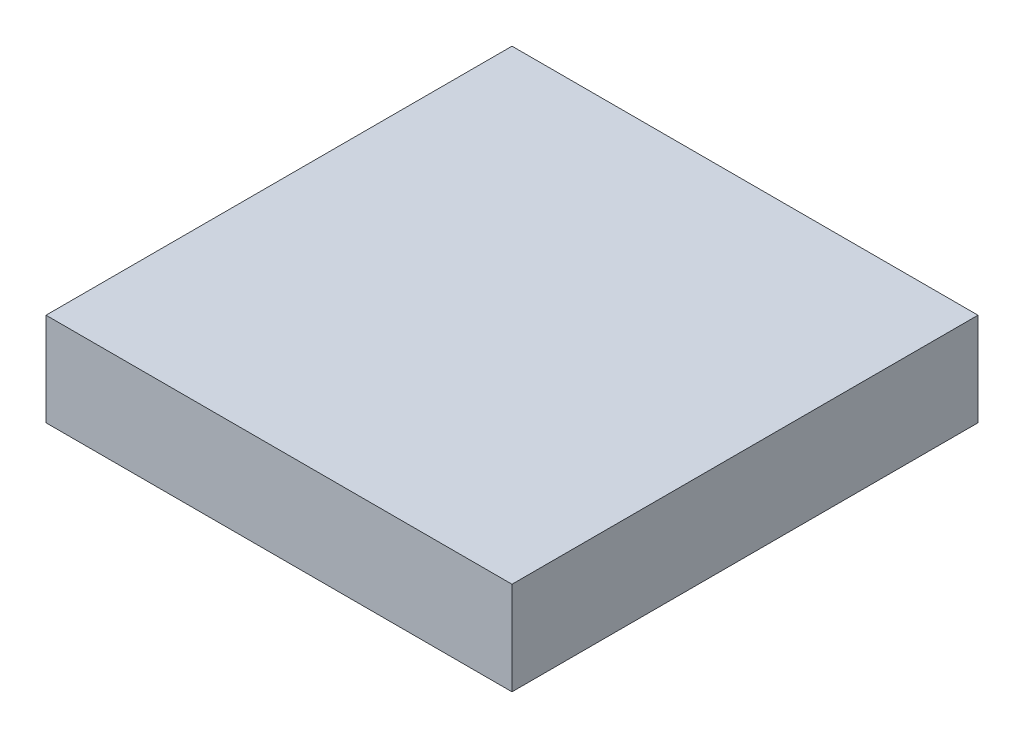
ISO-10303-21;
HEADER;
FILE_DESCRIPTION(('STEP AP214'),'2;1');
FILE_NAME('part.step','',(''),(''),'','','');
FILE_SCHEMA(('AUTOMOTIVE_DESIGN { 1 0 10303 214 1 1 1 1 }'));
ENDSEC;
DATA;
#1=APPLICATION_CONTEXT('core data for automotive mechanical design processes');
#2=APPLICATION_PROTOCOL_DEFINITION('international standard','automotive_design',2000,#1);
#3=PRODUCT_CONTEXT('',#1,'mechanical');
#4=PRODUCT('Part','Part','',(#3));
#5=PRODUCT_RELATED_PRODUCT_CATEGORY('part','',(#4));
#6=PRODUCT_DEFINITION_FORMATION('','',#4);
#7=PRODUCT_DEFINITION_CONTEXT('part definition',#1,'design');
#8=PRODUCT_DEFINITION('design','',#6,#7);
#9=PRODUCT_DEFINITION_SHAPE('','',#8);
#10=(LENGTH_UNIT() NAMED_UNIT(*) SI_UNIT(.MILLI.,.METRE.));
#11=(NAMED_UNIT(*) PLANE_ANGLE_UNIT() SI_UNIT($,.RADIAN.));
#12=(NAMED_UNIT(*) SI_UNIT($,.STERADIAN.) SOLID_ANGLE_UNIT());
#13=UNCERTAINTY_MEASURE_WITH_UNIT(LENGTH_MEASURE(1.E-05),#10,'distance_accuracy_value','');
#14=(GEOMETRIC_REPRESENTATION_CONTEXT(3) GLOBAL_UNCERTAINTY_ASSIGNED_CONTEXT((#13)) GLOBAL_UNIT_ASSIGNED_CONTEXT((#10,
#11,#12)) REPRESENTATION_CONTEXT('',''));
#15=CARTESIAN_POINT('',(0.,0.,0.));
#16=DIRECTION('',(0.,0.,1.));
#17=DIRECTION('',(1.,0.,0.));
#18=AXIS2_PLACEMENT_3D('',#15,#16,#17);
#19=CARTESIAN_POINT('',(0.2499995,-0.0499999,0.));
#20=DIRECTION('',(0.,-1.,0.));
#21=DIRECTION('',(0.,0.,-1.));
#22=AXIS2_PLACEMENT_3D('',#19,#20,#21);
#23=PLANE('',#22);
#24=DIRECTION('',(0.,0.,1.));
#25=VECTOR('',#24,1.);
#26=CARTESIAN_POINT('',(-0.2499995,-0.0499999,0.));
#27=LINE('',#26,#25);
#28=CARTESIAN_POINT('',(-0.2499995,-0.0499999,0.));
#29=VERTEX_POINT('',#28);
#30=CARTESIAN_POINT('',(-0.2499995,-0.0499999,0.499999));
#31=VERTEX_POINT('',#30);
#32=EDGE_CURVE('E20',#29,#31,#27,.T.);
#33=ORIENTED_EDGE('',*,*,#32,.F.);
#34=DIRECTION('',(1.,0.,0.));
#35=VECTOR('',#34,1.);
#36=CARTESIAN_POINT('',(-0.2499995,-0.0499999,0.));
#37=LINE('',#36,#35);
#38=CARTESIAN_POINT('',(0.2499995,-0.0499999,0.));
#39=VERTEX_POINT('',#38);
#40=EDGE_CURVE('E79',#29,#39,#37,.T.);
#41=ORIENTED_EDGE('',*,*,#40,.T.);
#42=DIRECTION('',(0.,0.,-1.));
#43=VECTOR('',#42,1.);
#44=CARTESIAN_POINT('',(0.2499995,-0.0499999,0.));
#45=LINE('',#44,#43);
#46=CARTESIAN_POINT('',(0.2499995,-0.0499999,0.499999));
#47=VERTEX_POINT('',#46);
#48=EDGE_CURVE('E61',#47,#39,#45,.T.);
#49=ORIENTED_EDGE('',*,*,#48,.F.);
#50=DIRECTION('',(1.,0.,0.));
#51=VECTOR('',#50,1.);
#52=CARTESIAN_POINT('',(-0.2499995,-0.0499999,0.499999));
#53=LINE('',#52,#51);
#54=EDGE_CURVE('E56',#31,#47,#53,.T.);
#55=ORIENTED_EDGE('',*,*,#54,.F.);
#56=EDGE_LOOP('',(#33,#41,#49,#55));
#57=FACE_BOUND('',#56,.T.);
#58=ADVANCED_FACE('F17',(#57),#23,.T.);
#59=CARTESIAN_POINT('',(-0.2499995,-0.0499999,0.));
#60=DIRECTION('',(-1.,0.,0.));
#61=DIRECTION('',(0.,0.,1.));
#62=AXIS2_PLACEMENT_3D('',#59,#60,#61);
#63=PLANE('',#62);
#64=DIRECTION('',(0.,0.,1.));
#65=VECTOR('',#64,1.);
#66=CARTESIAN_POINT('',(-0.2499995,0.05000244,0.));
#67=LINE('',#66,#65);
#68=CARTESIAN_POINT('',(-0.2499995,0.05000244,0.));
#69=VERTEX_POINT('',#68);
#70=CARTESIAN_POINT('',(-0.2499995,0.05000244,0.499999));
#71=VERTEX_POINT('',#70);
#72=EDGE_CURVE('E83',#69,#71,#67,.T.);
#73=ORIENTED_EDGE('',*,*,#72,.F.);
#74=DIRECTION('',(0.,1.,0.));
#75=VECTOR('',#74,1.);
#76=CARTESIAN_POINT('',(-0.2499995,-0.0499999,0.));
#77=LINE('',#76,#75);
#78=EDGE_CURVE('E68',#69,#29,#77,.F.);
#79=ORIENTED_EDGE('',*,*,#78,.T.);
#80=ORIENTED_EDGE('',*,*,#32,.T.);
#81=DIRECTION('',(0.,1.,0.));
#82=VECTOR('',#81,1.);
#83=CARTESIAN_POINT('',(-0.2499995,-0.0499999,0.499999));
#84=LINE('',#83,#82);
#85=EDGE_CURVE('E63',#71,#31,#84,.F.);
#86=ORIENTED_EDGE('',*,*,#85,.F.);
#87=EDGE_LOOP('',(#73,#79,#80,#86));
#88=FACE_BOUND('',#87,.T.);
#89=ADVANCED_FACE('F65',(#88),#63,.T.);
#90=CARTESIAN_POINT('',(-0.2499995,-0.0499999,0.499999));
#91=DIRECTION('',(0.,0.,1.));
#92=DIRECTION('',(1.,0.,0.));
#93=AXIS2_PLACEMENT_3D('',#90,#91,#92);
#94=PLANE('',#93);
#95=DIRECTION('',(1.,0.,0.));
#96=VECTOR('',#95,1.);
#97=CARTESIAN_POINT('',(-0.2499995,0.05000244,0.499999));
#98=LINE('',#97,#96);
#99=CARTESIAN_POINT('',(0.2499995,0.05000244,0.499999));
#100=VERTEX_POINT('',#99);
#101=EDGE_CURVE('E72',#71,#100,#98,.T.);
#102=ORIENTED_EDGE('',*,*,#101,.F.);
#103=ORIENTED_EDGE('',*,*,#85,.T.);
#104=ORIENTED_EDGE('',*,*,#54,.T.);
#105=DIRECTION('',(0.,1.,0.));
#106=VECTOR('',#105,1.);
#107=CARTESIAN_POINT('',(0.2499995,0.05000244,0.499999));
#108=LINE('',#107,#106);
#109=EDGE_CURVE('E74',#100,#47,#108,.F.);
#110=ORIENTED_EDGE('',*,*,#109,.F.);
#111=EDGE_LOOP('',(#102,#103,#104,#110));
#112=FACE_BOUND('',#111,.T.);
#113=ADVANCED_FACE('F70',(#112),#94,.T.);
#114=CARTESIAN_POINT('',(0.2499995,0.05000244,0.));
#115=DIRECTION('',(1.,0.,0.));
#116=DIRECTION('',(0.,0.,-1.));
#117=AXIS2_PLACEMENT_3D('',#114,#115,#116);
#118=PLANE('',#117);
#119=ORIENTED_EDGE('',*,*,#48,.T.);
#120=DIRECTION('',(0.,1.,0.));
#121=VECTOR('',#120,1.);
#122=CARTESIAN_POINT('',(0.2499995,-0.0499999,0.));
#123=LINE('',#122,#121);
#124=CARTESIAN_POINT('',(0.2499995,0.05000244,0.));
#125=VERTEX_POINT('',#124);
#126=EDGE_CURVE('E35',#39,#125,#123,.T.);
#127=ORIENTED_EDGE('',*,*,#126,.T.);
#128=DIRECTION('',(0.,0.,1.));
#129=VECTOR('',#128,1.);
#130=CARTESIAN_POINT('',(0.2499995,0.05000244,0.));
#131=LINE('',#130,#129);
#132=EDGE_CURVE('E26',#100,#125,#131,.F.);
#133=ORIENTED_EDGE('',*,*,#132,.F.);
#134=ORIENTED_EDGE('',*,*,#109,.T.);
#135=EDGE_LOOP('',(#119,#127,#133,#134));
#136=FACE_BOUND('',#135,.T.);
#137=ADVANCED_FACE('F89',(#136),#118,.T.);
#138=CARTESIAN_POINT('',(-0.2499995,-0.0499999,0.));
#139=DIRECTION('',(0.,0.,1.));
#140=DIRECTION('',(1.,0.,0.));
#141=AXIS2_PLACEMENT_3D('',#138,#139,#140);
#142=PLANE('',#141);
#143=DIRECTION('',(1.,0.,0.));
#144=VECTOR('',#143,1.);
#145=CARTESIAN_POINT('',(-0.2499995,0.05000244,0.));
#146=LINE('',#145,#144);
#147=EDGE_CURVE('E11',#125,#69,#146,.F.);
#148=ORIENTED_EDGE('',*,*,#147,.F.);
#149=ORIENTED_EDGE('',*,*,#126,.F.);
#150=ORIENTED_EDGE('',*,*,#40,.F.);
#151=ORIENTED_EDGE('',*,*,#78,.F.);
#152=EDGE_LOOP('',(#148,#149,#150,#151));
#153=FACE_BOUND('',#152,.T.);
#154=ADVANCED_FACE('F91',(#153),#142,.F.);
#155=CARTESIAN_POINT('',(-0.2499995,0.05000244,0.));
#156=DIRECTION('',(0.,1.,0.));
#157=DIRECTION('',(0.,0.,1.));
#158=AXIS2_PLACEMENT_3D('',#155,#156,#157);
#159=PLANE('',#158);
#160=ORIENTED_EDGE('',*,*,#132,.T.);
#161=ORIENTED_EDGE('',*,*,#147,.T.);
#162=ORIENTED_EDGE('',*,*,#72,.T.);
#163=ORIENTED_EDGE('',*,*,#101,.T.);
#164=EDGE_LOOP('',(#160,#161,#162,#163));
#165=FACE_BOUND('',#164,.T.);
#166=ADVANCED_FACE('F88',(#165),#159,.T.);
#167=CLOSED_SHELL('',(#58,#89,#113,#137,#154,#166));
#168=MANIFOLD_SOLID_BREP('B1',#167);
#169=ADVANCED_BREP_SHAPE_REPRESENTATION('',(#18,#168),#14);
#170=SHAPE_DEFINITION_REPRESENTATION(#9,#169);
ENDSEC;
END-ISO-10303-21;
